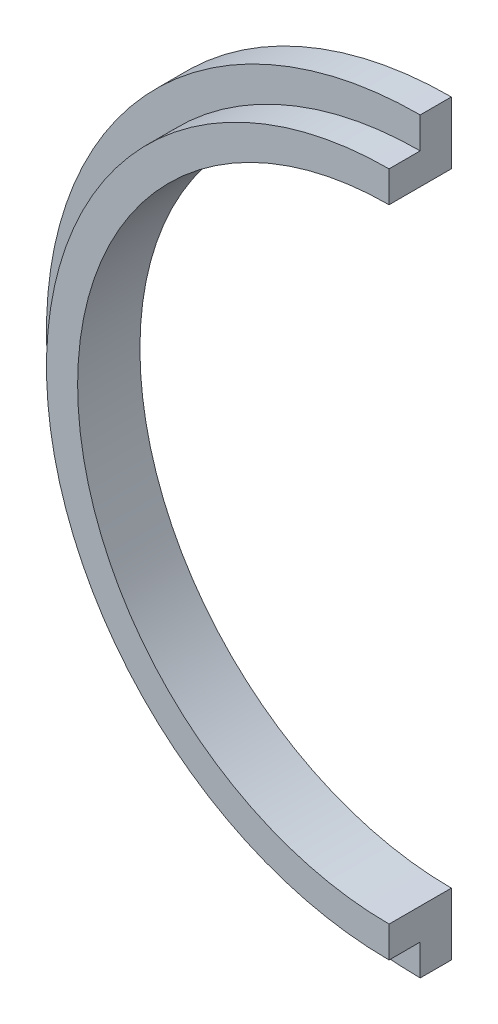
ISO-10303-21;
HEADER;
FILE_DESCRIPTION(('STEP AP214'),'2;1');
FILE_NAME('part.step','',(''),(''),'','','');
FILE_SCHEMA(('AUTOMOTIVE_DESIGN { 1 0 10303 214 1 1 1 1 }'));
ENDSEC;
DATA;
#1=APPLICATION_CONTEXT('core data for automotive mechanical design processes');
#2=APPLICATION_PROTOCOL_DEFINITION('international standard','automotive_design',2000,#1);
#3=PRODUCT_CONTEXT('',#1,'mechanical');
#4=PRODUCT('Part','Part','',(#3));
#5=PRODUCT_RELATED_PRODUCT_CATEGORY('part','',(#4));
#6=PRODUCT_DEFINITION_FORMATION('','',#4);
#7=PRODUCT_DEFINITION_CONTEXT('part definition',#1,'design');
#8=PRODUCT_DEFINITION('design','',#6,#7);
#9=PRODUCT_DEFINITION_SHAPE('','',#8);
#10=(LENGTH_UNIT() NAMED_UNIT(*) SI_UNIT(.MILLI.,.METRE.));
#11=(NAMED_UNIT(*) PLANE_ANGLE_UNIT() SI_UNIT($,.RADIAN.));
#12=(NAMED_UNIT(*) SI_UNIT($,.STERADIAN.) SOLID_ANGLE_UNIT());
#13=UNCERTAINTY_MEASURE_WITH_UNIT(LENGTH_MEASURE(1.E-05),#10,'distance_accuracy_value','');
#14=(GEOMETRIC_REPRESENTATION_CONTEXT(3) GLOBAL_UNCERTAINTY_ASSIGNED_CONTEXT((#13)) GLOBAL_UNIT_ASSIGNED_CONTEXT((#10,
#11,#12)) REPRESENTATION_CONTEXT('',''));
#15=CARTESIAN_POINT('',(0.,0.,0.));
#16=DIRECTION('',(0.,0.,1.));
#17=DIRECTION('',(1.,0.,0.));
#18=AXIS2_PLACEMENT_3D('',#15,#16,#17);
#19=CARTESIAN_POINT('',(0.,0.,15.));
#20=DIRECTION('',(0.,0.,1.));
#21=DIRECTION('',(1.,0.,0.));
#22=AXIS2_PLACEMENT_3D('',#19,#20,#21);
#23=PLANE('',#22);
#24=CARTESIAN_POINT('',(0.,0.,15.));
#25=DIRECTION('',(0.,0.,1.));
#26=DIRECTION('',(1.,0.,0.));
#27=AXIS2_PLACEMENT_3D('',#24,#25,#26);
#28=CIRCLE('',#27,180.);
#29=CARTESIAN_POINT('',(0.,180.,15.));
#30=VERTEX_POINT('',#29);
#31=CARTESIAN_POINT('',(0.,-180.,15.));
#32=VERTEX_POINT('',#31);
#33=EDGE_CURVE('E11',#30,#32,#28,.T.);
#34=ORIENTED_EDGE('',*,*,#33,.T.);
#35=DIRECTION('',(0.,-1.,0.));
#36=VECTOR('',#35,1.);
#37=CARTESIAN_POINT('',(0.,180.,15.));
#38=LINE('',#37,#36);
#39=CARTESIAN_POINT('',(0.,-165.,15.));
#40=VERTEX_POINT('',#39);
#41=EDGE_CURVE('E131',#40,#32,#38,.T.);
#42=ORIENTED_EDGE('',*,*,#41,.F.);
#43=CARTESIAN_POINT('',(0.,0.,15.));
#44=DIRECTION('',(0.,0.,1.));
#45=DIRECTION('',(1.,0.,0.));
#46=AXIS2_PLACEMENT_3D('',#43,#44,#45);
#47=CIRCLE('',#46,165.);
#48=CARTESIAN_POINT('',(0.,165.,15.));
#49=VERTEX_POINT('',#48);
#50=EDGE_CURVE('E119',#49,#40,#47,.T.);
#51=ORIENTED_EDGE('',*,*,#50,.F.);
#52=EDGE_CURVE('E56',#30,#49,#38,.T.);
#53=ORIENTED_EDGE('',*,*,#52,.F.);
#54=EDGE_LOOP('',(#34,#42,#51,#53));
#55=FACE_BOUND('',#54,.T.);
#56=ADVANCED_FACE('F41',(#55),#23,.T.);
#57=CARTESIAN_POINT('',(0.,0.,0.));
#58=DIRECTION('',(0.,0.,1.));
#59=DIRECTION('',(1.,0.,0.));
#60=AXIS2_PLACEMENT_3D('',#57,#58,#59);
#61=PLANE('',#60);
#62=DIRECTION('',(0.,-1.,0.));
#63=VECTOR('',#62,1.);
#64=CARTESIAN_POINT('',(0.,180.,0.));
#65=LINE('',#64,#63);
#66=CARTESIAN_POINT('',(0.,-150.,0.));
#67=VERTEX_POINT('',#66);
#68=CARTESIAN_POINT('',(0.,-180.,0.));
#69=VERTEX_POINT('',#68);
#70=EDGE_CURVE('E92',#67,#69,#65,.T.);
#71=ORIENTED_EDGE('',*,*,#70,.T.);
#72=CARTESIAN_POINT('',(0.,0.,0.));
#73=DIRECTION('',(0.,0.,1.));
#74=DIRECTION('',(1.,0.,0.));
#75=AXIS2_PLACEMENT_3D('',#72,#73,#74);
#76=CIRCLE('',#75,180.);
#77=CARTESIAN_POINT('',(0.,180.,0.));
#78=VERTEX_POINT('',#77);
#79=EDGE_CURVE('E45',#78,#69,#76,.T.);
#80=ORIENTED_EDGE('',*,*,#79,.F.);
#81=CARTESIAN_POINT('',(0.,150.,0.));
#82=VERTEX_POINT('',#81);
#83=EDGE_CURVE('E102',#78,#82,#65,.T.);
#84=ORIENTED_EDGE('',*,*,#83,.T.);
#85=CARTESIAN_POINT('',(0.,0.,0.));
#86=DIRECTION('',(0.,0.,1.));
#87=DIRECTION('',(1.,0.,0.));
#88=AXIS2_PLACEMENT_3D('',#85,#86,#87);
#89=CIRCLE('',#88,150.);
#90=EDGE_CURVE('E109',#82,#67,#89,.T.);
#91=ORIENTED_EDGE('',*,*,#90,.T.);
#92=EDGE_LOOP('',(#71,#80,#84,#91));
#93=FACE_BOUND('',#92,.T.);
#94=ADVANCED_FACE('F115',(#93),#61,.F.);
#95=CARTESIAN_POINT('',(0.,0.,15.));
#96=DIRECTION('',(0.,0.,-1.));
#97=DIRECTION('',(-1.,0.,0.));
#98=AXIS2_PLACEMENT_3D('',#95,#96,#97);
#99=CYLINDRICAL_SURFACE('',#98,180.);
#100=DIRECTION('',(0.,0.,-1.));
#101=VECTOR('',#100,1.);
#102=CARTESIAN_POINT('',(0.,-180.,15.));
#103=LINE('',#102,#101);
#104=EDGE_CURVE('E97',#69,#32,#103,.F.);
#105=ORIENTED_EDGE('',*,*,#104,.T.);
#106=ORIENTED_EDGE('',*,*,#33,.F.);
#107=DIRECTION('',(0.,0.,-1.));
#108=VECTOR('',#107,1.);
#109=CARTESIAN_POINT('',(0.,180.,15.));
#110=LINE('',#109,#108);
#111=EDGE_CURVE('E133',#30,#78,#110,.T.);
#112=ORIENTED_EDGE('',*,*,#111,.T.);
#113=ORIENTED_EDGE('',*,*,#79,.T.);
#114=EDGE_LOOP('',(#105,#106,#112,#113));
#115=FACE_BOUND('',#114,.T.);
#116=ADVANCED_FACE('F43',(#115),#99,.T.);
#117=CARTESIAN_POINT('',(0.,0.,15.));
#118=DIRECTION('',(0.,0.,-1.));
#119=DIRECTION('',(-1.,0.,0.));
#120=AXIS2_PLACEMENT_3D('',#117,#118,#119);
#121=CYLINDRICAL_SURFACE('',#120,150.);
#122=CARTESIAN_POINT('',(0.,0.,30.));
#123=DIRECTION('',(0.,0.,1.));
#124=DIRECTION('',(1.,0.,0.));
#125=AXIS2_PLACEMENT_3D('',#122,#123,#124);
#126=CIRCLE('',#125,150.);
#127=CARTESIAN_POINT('',(0.,150.,30.));
#128=VERTEX_POINT('',#127);
#129=CARTESIAN_POINT('',(0.,-150.,30.));
#130=VERTEX_POINT('',#129);
#131=EDGE_CURVE('E111',#128,#130,#126,.T.);
#132=ORIENTED_EDGE('',*,*,#131,.T.);
#133=DIRECTION('',(0.,0.,-1.));
#134=VECTOR('',#133,1.);
#135=CARTESIAN_POINT('',(0.,-150.,15.));
#136=LINE('',#135,#134);
#137=EDGE_CURVE('E95',#67,#130,#136,.F.);
#138=ORIENTED_EDGE('',*,*,#137,.F.);
#139=ORIENTED_EDGE('',*,*,#90,.F.);
#140=DIRECTION('',(0.,0.,-1.));
#141=VECTOR('',#140,1.);
#142=CARTESIAN_POINT('',(0.,150.,15.));
#143=LINE('',#142,#141);
#144=EDGE_CURVE('E112',#128,#82,#143,.T.);
#145=ORIENTED_EDGE('',*,*,#144,.F.);
#146=EDGE_LOOP('',(#132,#138,#139,#145));
#147=FACE_BOUND('',#146,.T.);
#148=ADVANCED_FACE('F107',(#147),#121,.F.);
#149=CARTESIAN_POINT('',(0.,0.,30.));
#150=DIRECTION('',(0.,0.,1.));
#151=DIRECTION('',(1.,0.,0.));
#152=AXIS2_PLACEMENT_3D('',#149,#150,#151);
#153=PLANE('',#152);
#154=CARTESIAN_POINT('',(0.,0.,30.));
#155=DIRECTION('',(0.,0.,1.));
#156=DIRECTION('',(1.,0.,0.));
#157=AXIS2_PLACEMENT_3D('',#154,#155,#156);
#158=CIRCLE('',#157,165.);
#159=CARTESIAN_POINT('',(0.,165.,30.));
#160=VERTEX_POINT('',#159);
#161=CARTESIAN_POINT('',(0.,-165.,30.));
#162=VERTEX_POINT('',#161);
#163=EDGE_CURVE('E116',#160,#162,#158,.T.);
#164=ORIENTED_EDGE('',*,*,#163,.T.);
#165=DIRECTION('',(0.,-1.,0.));
#166=VECTOR('',#165,1.);
#167=CARTESIAN_POINT('',(0.,180.,30.));
#168=LINE('',#167,#166);
#169=EDGE_CURVE('E64',#130,#162,#168,.T.);
#170=ORIENTED_EDGE('',*,*,#169,.F.);
#171=ORIENTED_EDGE('',*,*,#131,.F.);
#172=EDGE_CURVE('E127',#160,#128,#168,.T.);
#173=ORIENTED_EDGE('',*,*,#172,.F.);
#174=EDGE_LOOP('',(#164,#170,#171,#173));
#175=FACE_BOUND('',#174,.T.);
#176=ADVANCED_FACE('F140',(#175),#153,.T.);
#177=CARTESIAN_POINT('',(0.,0.,30.));
#178=DIRECTION('',(0.,0.,-1.));
#179=DIRECTION('',(-1.,0.,0.));
#180=AXIS2_PLACEMENT_3D('',#177,#178,#179);
#181=CYLINDRICAL_SURFACE('',#180,165.);
#182=DIRECTION('',(0.,0.,-1.));
#183=VECTOR('',#182,1.);
#184=CARTESIAN_POINT('',(0.,-165.,30.));
#185=LINE('',#184,#183);
#186=EDGE_CURVE('E125',#40,#162,#185,.F.);
#187=ORIENTED_EDGE('',*,*,#186,.T.);
#188=ORIENTED_EDGE('',*,*,#163,.F.);
#189=DIRECTION('',(0.,0.,-1.));
#190=VECTOR('',#189,1.);
#191=CARTESIAN_POINT('',(0.,165.,30.));
#192=LINE('',#191,#190);
#193=EDGE_CURVE('E129',#160,#49,#192,.T.);
#194=ORIENTED_EDGE('',*,*,#193,.T.);
#195=ORIENTED_EDGE('',*,*,#50,.T.);
#196=EDGE_LOOP('',(#187,#188,#194,#195));
#197=FACE_BOUND('',#196,.T.);
#198=ADVANCED_FACE('F143',(#197),#181,.T.);
#199=CARTESIAN_POINT('',(0.,180.,30.001));
#200=DIRECTION('',(1.,0.,0.));
#201=DIRECTION('',(0.,0.,-1.));
#202=AXIS2_PLACEMENT_3D('',#199,#200,#201);
#203=PLANE('',#202);
#204=ORIENTED_EDGE('',*,*,#52,.T.);
#205=ORIENTED_EDGE('',*,*,#193,.F.);
#206=ORIENTED_EDGE('',*,*,#172,.T.);
#207=ORIENTED_EDGE('',*,*,#144,.T.);
#208=ORIENTED_EDGE('',*,*,#83,.F.);
#209=ORIENTED_EDGE('',*,*,#111,.F.);
#210=EDGE_LOOP('',(#204,#205,#206,#207,#208,#209));
#211=FACE_BOUND('',#210,.T.);
#212=ADVANCED_FACE('F137',(#211),#203,.T.);
#213=ORIENTED_EDGE('',*,*,#41,.T.);
#214=ORIENTED_EDGE('',*,*,#104,.F.);
#215=ORIENTED_EDGE('',*,*,#70,.F.);
#216=ORIENTED_EDGE('',*,*,#137,.T.);
#217=ORIENTED_EDGE('',*,*,#169,.T.);
#218=ORIENTED_EDGE('',*,*,#186,.F.);
#219=EDGE_LOOP('',(#213,#214,#215,#216,#217,#218));
#220=FACE_BOUND('',#219,.T.);
#221=ADVANCED_FACE('F94',(#220),#203,.T.);
#222=CLOSED_SHELL('',(#56,#94,#116,#148,#176,#198,#212,#221));
#223=MANIFOLD_SOLID_BREP('B2',#222);
#224=ADVANCED_BREP_SHAPE_REPRESENTATION('',(#18,#223),#14);
#225=SHAPE_DEFINITION_REPRESENTATION(#9,#224);
ENDSEC;
END-ISO-10303-21;
